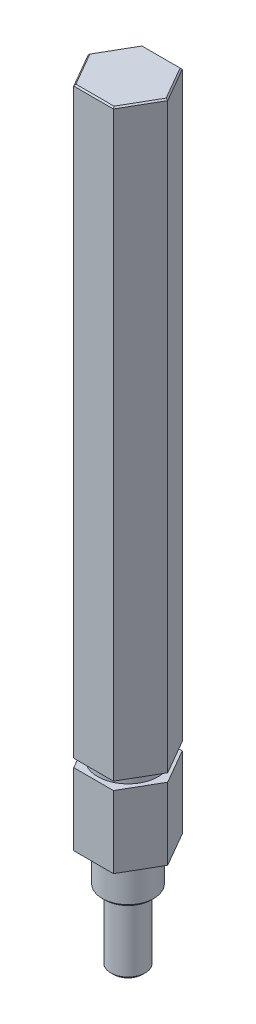
ISO-10303-21;
HEADER;
FILE_DESCRIPTION(('STEP AP214'),'2;1');
FILE_NAME('part.step','',(''),(''),'','','');
FILE_SCHEMA(('AUTOMOTIVE_DESIGN { 1 0 10303 214 1 1 1 1 }'));
ENDSEC;
DATA;
#1=APPLICATION_CONTEXT('core data for automotive mechanical design processes');
#2=APPLICATION_PROTOCOL_DEFINITION('international standard','automotive_design',2000,#1);
#3=PRODUCT_CONTEXT('',#1,'mechanical');
#4=PRODUCT('Part','Part','',(#3));
#5=PRODUCT_RELATED_PRODUCT_CATEGORY('part','',(#4));
#6=PRODUCT_DEFINITION_FORMATION('','',#4);
#7=PRODUCT_DEFINITION_CONTEXT('part definition',#1,'design');
#8=PRODUCT_DEFINITION('design','',#6,#7);
#9=PRODUCT_DEFINITION_SHAPE('','',#8);
#10=(LENGTH_UNIT() NAMED_UNIT(*) SI_UNIT(.MILLI.,.METRE.));
#11=(NAMED_UNIT(*) PLANE_ANGLE_UNIT() SI_UNIT($,.RADIAN.));
#12=(NAMED_UNIT(*) SI_UNIT($,.STERADIAN.) SOLID_ANGLE_UNIT());
#13=UNCERTAINTY_MEASURE_WITH_UNIT(LENGTH_MEASURE(1.E-05),#10,'distance_accuracy_value','');
#14=(GEOMETRIC_REPRESENTATION_CONTEXT(3) GLOBAL_UNCERTAINTY_ASSIGNED_CONTEXT((#13)) GLOBAL_UNIT_ASSIGNED_CONTEXT((#10,
#11,#12)) REPRESENTATION_CONTEXT('',''));
#15=CARTESIAN_POINT('',(0.,0.,0.));
#16=DIRECTION('',(0.,0.,1.));
#17=DIRECTION('',(1.,0.,0.));
#18=AXIS2_PLACEMENT_3D('',#15,#16,#17);
#19=CARTESIAN_POINT('',(-38.3071337161431,-45.212,-16.669011646302));
#20=DIRECTION('',(0.,1.,0.));
#21=DIRECTION('',(0.,0.,1.));
#22=AXIS2_PLACEMENT_3D('',#19,#20,#21);
#23=PLANE('',#22);
#24=CARTESIAN_POINT('',(-38.3071337161431,-45.2119999999923,-16.669011646302));
#25=DIRECTION('',(0.,1.,0.));
#26=DIRECTION('',(0.,0.,1.));
#27=AXIS2_PLACEMENT_3D('',#24,#25,#26);
#28=CIRCLE('',#27,2.65430000009029);
#29=CARTESIAN_POINT('',(-38.3071337161431,-45.2119999999923,-14.0147116462117));
#30=VERTEX_POINT('',#29);
#31=EDGE_CURVE('E17',#30,#30,#28,.T.);
#32=ORIENTED_EDGE('',*,*,#31,.F.);
#33=EDGE_LOOP('',(#32));
#34=FACE_BOUND('',#33,.T.);
#35=ADVANCED_FACE('F14',(#34),#23,.F.);
#36=CARTESIAN_POINT('',(-38.3071337161431,-44.704000000138,-16.669011646302));
#37=DIRECTION('',(0.,1.,0.));
#38=DIRECTION('',(0.,0.,1.));
#39=AXIS2_PLACEMENT_3D('',#36,#37,#38);
#40=CONICAL_SURFACE('',#39,3.16229999994458,0.785398163397448);
#41=CARTESIAN_POINT('',(-38.3071337161431,-44.704,-16.669011646302));
#42=DIRECTION('',(0.,1.,0.));
#43=DIRECTION('',(0.,0.,1.));
#44=AXIS2_PLACEMENT_3D('',#41,#42,#43);
#45=CIRCLE('',#44,3.1623);
#46=CARTESIAN_POINT('',(-38.3071337161431,-44.704,-13.506711646302));
#47=VERTEX_POINT('',#46);
#48=EDGE_CURVE('E151',#47,#47,#45,.T.);
#49=ORIENTED_EDGE('',*,*,#48,.F.);
#50=EDGE_LOOP('',(#49));
#51=FACE_BOUND('',#50,.T.);
#52=ORIENTED_EDGE('',*,*,#31,.T.);
#53=EDGE_LOOP('',(#52));
#54=FACE_BOUND('',#53,.T.);
#55=ADVANCED_FACE('F187',(#51,#54),#40,.T.);
#56=CARTESIAN_POINT('',(-38.3071337161431,-45.212,-16.669011646302));
#57=DIRECTION('',(0.,1.,0.));
#58=DIRECTION('',(0.,0.,1.));
#59=AXIS2_PLACEMENT_3D('',#56,#57,#58);
#60=CYLINDRICAL_SURFACE('',#59,3.1623);
#61=CARTESIAN_POINT('',(-38.3071337161431,-32.512,-16.669011646302));
#62=DIRECTION('',(0.,1.,0.));
#63=DIRECTION('',(0.,0.,1.));
#64=AXIS2_PLACEMENT_3D('',#61,#62,#63);
#65=CIRCLE('',#64,3.1623);
#66=CARTESIAN_POINT('',(-38.3071337161431,-32.512,-13.506711646302));
#67=VERTEX_POINT('',#66);
#68=EDGE_CURVE('E154',#67,#67,#65,.F.);
#69=ORIENTED_EDGE('',*,*,#68,.T.);
#70=EDGE_LOOP('',(#69));
#71=FACE_BOUND('',#70,.T.);
#72=ORIENTED_EDGE('',*,*,#48,.T.);
#73=EDGE_LOOP('',(#72));
#74=FACE_BOUND('',#73,.T.);
#75=ADVANCED_FACE('F171',(#71,#74),#60,.T.);
#76=CARTESIAN_POINT('',(-38.3071337161431,-32.512,-16.669011646302));
#77=DIRECTION('',(0.,1.,0.));
#78=DIRECTION('',(0.,0.,1.));
#79=AXIS2_PLACEMENT_3D('',#76,#77,#78);
#80=PLANE('',#79);
#81=CARTESIAN_POINT('',(-38.3071337161431,-32.511999999997,-16.669011646302));
#82=DIRECTION('',(0.,1.,0.));
#83=DIRECTION('',(0.,0.,1.));
#84=AXIS2_PLACEMENT_3D('',#81,#82,#83);
#85=CIRCLE('',#84,4.24179999994759);
#86=CARTESIAN_POINT('',(-38.3071337161431,-32.511999999997,-12.4272116463544));
#87=VERTEX_POINT('',#86);
#88=EDGE_CURVE('E150',#87,#87,#85,.T.);
#89=ORIENTED_EDGE('',*,*,#88,.F.);
#90=EDGE_LOOP('',(#89));
#91=FACE_BOUND('',#90,.T.);
#92=ORIENTED_EDGE('',*,*,#68,.F.);
#93=EDGE_LOOP('',(#92));
#94=FACE_BOUND('',#93,.T.);
#95=ADVANCED_FACE('F174',(#91,#94),#80,.F.);
#96=CARTESIAN_POINT('',(-38.3071337161431,-32.0039999999722,-16.669011646302));
#97=DIRECTION('',(0.,1.,0.));
#98=DIRECTION('',(0.,0.,1.));
#99=AXIS2_PLACEMENT_3D('',#96,#97,#98);
#100=CONICAL_SURFACE('',#99,4.74979999991557,0.7853981633415);
#101=CARTESIAN_POINT('',(-38.3071337161431,-32.004,-16.669011646302));
#102=DIRECTION('',(0.,1.,0.));
#103=DIRECTION('',(0.,0.,1.));
#104=AXIS2_PLACEMENT_3D('',#101,#102,#103);
#105=CIRCLE('',#104,4.7498);
#106=CARTESIAN_POINT('',(-38.3071337161431,-32.004,-11.919211646302));
#107=VERTEX_POINT('',#106);
#108=EDGE_CURVE('E147',#107,#107,#105,.T.);
#109=ORIENTED_EDGE('',*,*,#108,.F.);
#110=EDGE_LOOP('',(#109));
#111=FACE_BOUND('',#110,.T.);
#112=ORIENTED_EDGE('',*,*,#88,.T.);
#113=EDGE_LOOP('',(#112));
#114=FACE_BOUND('',#113,.T.);
#115=ADVANCED_FACE('F176',(#111,#114),#100,.T.);
#116=CARTESIAN_POINT('',(-38.3071337161431,-32.512,-16.669011646302));
#117=DIRECTION('',(0.,1.,0.));
#118=DIRECTION('',(0.,0.,1.));
#119=AXIS2_PLACEMENT_3D('',#116,#117,#118);
#120=CYLINDRICAL_SURFACE('',#119,4.7498);
#121=CARTESIAN_POINT('',(-38.3071337161431,-25.4,-16.669011646302));
#122=DIRECTION('',(0.,1.,0.));
#123=DIRECTION('',(0.,0.,1.));
#124=AXIS2_PLACEMENT_3D('',#121,#122,#123);
#125=CIRCLE('',#124,4.7498);
#126=CARTESIAN_POINT('',(-38.3071337161431,-25.4,-11.919211646302));
#127=VERTEX_POINT('',#126);
#128=EDGE_CURVE('E129',#127,#127,#125,.F.);
#129=ORIENTED_EDGE('',*,*,#128,.T.);
#130=EDGE_LOOP('',(#129));
#131=FACE_BOUND('',#130,.T.);
#132=ORIENTED_EDGE('',*,*,#108,.T.);
#133=EDGE_LOOP('',(#132));
#134=FACE_BOUND('',#133,.T.);
#135=ADVANCED_FACE('F184',(#131,#134),#120,.T.);
#136=CARTESIAN_POINT('',(-38.3071337161431,-25.4,-3.96901164630201));
#137=DIRECTION('',(0.,1.,0.));
#138=DIRECTION('',(0.,0.,1.));
#139=AXIS2_PLACEMENT_3D('',#136,#137,#138);
#140=PLANE('',#139);
#141=DIRECTION('',(-0.5,0.,0.866025403784439));
#142=VECTOR('',#141,1.);
#143=CARTESIAN_POINT('',(-41.9733079254973,-25.4,-23.019011646302));
#144=LINE('',#143,#142);
#145=CARTESIAN_POINT('',(-41.9733079254973,-25.4,-23.019011646302));
#146=VERTEX_POINT('',#145);
#147=CARTESIAN_POINT('',(-45.6394821348514,-25.4,-16.669011646302));
#148=VERTEX_POINT('',#147);
#149=EDGE_CURVE('E121',#146,#148,#144,.T.);
#150=ORIENTED_EDGE('',*,*,#149,.F.);
#151=DIRECTION('',(-1.,0.,0.));
#152=VECTOR('',#151,1.);
#153=CARTESIAN_POINT('',(-34.640959506789,-25.4,-23.019011646302));
#154=LINE('',#153,#152);
#155=CARTESIAN_POINT('',(-34.640959506789,-25.4,-23.019011646302));
#156=VERTEX_POINT('',#155);
#157=EDGE_CURVE('E118',#156,#146,#154,.T.);
#158=ORIENTED_EDGE('',*,*,#157,.F.);
#159=DIRECTION('',(-0.5,0.,-0.866025403784439));
#160=VECTOR('',#159,1.);
#161=CARTESIAN_POINT('',(-30.9747852974349,-25.4,-16.669011646302));
#162=LINE('',#161,#160);
#163=CARTESIAN_POINT('',(-30.9747852974349,-25.4,-16.669011646302));
#164=VERTEX_POINT('',#163);
#165=EDGE_CURVE('E138',#164,#156,#162,.T.);
#166=ORIENTED_EDGE('',*,*,#165,.F.);
#167=DIRECTION('',(0.500000000000001,0.,-0.866025403784438));
#168=VECTOR('',#167,1.);
#169=CARTESIAN_POINT('',(-34.640959506789,-25.4,-10.319011646302));
#170=LINE('',#169,#168);
#171=CARTESIAN_POINT('',(-34.640959506789,-25.4,-10.319011646302));
#172=VERTEX_POINT('',#171);
#173=EDGE_CURVE('E480',#172,#164,#170,.T.);
#174=ORIENTED_EDGE('',*,*,#173,.F.);
#175=DIRECTION('',(1.,0.,0.));
#176=VECTOR('',#175,1.);
#177=CARTESIAN_POINT('',(-41.9733079254973,-25.4,-10.319011646302));
#178=LINE('',#177,#176);
#179=CARTESIAN_POINT('',(-41.9733079254973,-25.4,-10.319011646302));
#180=VERTEX_POINT('',#179);
#181=EDGE_CURVE('E485',#180,#172,#178,.T.);
#182=ORIENTED_EDGE('',*,*,#181,.F.);
#183=DIRECTION('',(0.5,0.,0.866025403784439));
#184=VECTOR('',#183,1.);
#185=CARTESIAN_POINT('',(-45.6394821348514,-25.4,-16.669011646302));
#186=LINE('',#185,#184);
#187=EDGE_CURVE('E126',#148,#180,#186,.T.);
#188=ORIENTED_EDGE('',*,*,#187,.F.);
#189=EDGE_LOOP('',(#150,#158,#166,#174,#182,#188));
#190=FACE_BOUND('',#189,.T.);
#191=ORIENTED_EDGE('',*,*,#128,.F.);
#192=EDGE_LOOP('',(#191));
#193=FACE_BOUND('',#192,.T.);
#194=ADVANCED_FACE('F123',(#190,#193),#140,.F.);
#195=CARTESIAN_POINT('',(-41.9733079254973,-25.4,-23.019011646302));
#196=DIRECTION('',(-0.866025403784439,0.,-0.5));
#197=DIRECTION('',(-0.5,0.,0.866025403784439));
#198=AXIS2_PLACEMENT_3D('',#195,#196,#197);
#199=PLANE('',#198);
#200=ORIENTED_EDGE('',*,*,#149,.T.);
#201=DIRECTION('',(0.,1.,0.));
#202=VECTOR('',#201,1.);
#203=CARTESIAN_POINT('',(-45.6394821348514,-25.4,-16.669011646302));
#204=LINE('',#203,#202);
#205=CARTESIAN_POINT('',(-45.6394821348514,-12.1158,-16.669011646302));
#206=VERTEX_POINT('',#205);
#207=EDGE_CURVE('E491',#206,#148,#204,.F.);
#208=ORIENTED_EDGE('',*,*,#207,.F.);
#209=DIRECTION('',(0.5,0.,-0.866025403784439));
#210=VECTOR('',#209,1.);
#211=CARTESIAN_POINT('',(-45.6394821348514,-12.1158,-16.669011646302));
#212=LINE('',#211,#210);
#213=CARTESIAN_POINT('',(-41.9733079254973,-12.1158,-23.019011646302));
#214=VERTEX_POINT('',#213);
#215=EDGE_CURVE('E135',#206,#214,#212,.T.);
#216=ORIENTED_EDGE('',*,*,#215,.T.);
#217=DIRECTION('',(0.,1.,0.));
#218=VECTOR('',#217,1.);
#219=CARTESIAN_POINT('',(-41.9733079254973,-25.4,-23.019011646302));
#220=LINE('',#219,#218);
#221=EDGE_CURVE('E132',#146,#214,#220,.T.);
#222=ORIENTED_EDGE('',*,*,#221,.F.);
#223=EDGE_LOOP('',(#200,#208,#216,#222));
#224=FACE_BOUND('',#223,.T.);
#225=ADVANCED_FACE('F133',(#224),#199,.T.);
#226=CARTESIAN_POINT('',(-34.640959506789,-25.4,-23.019011646302));
#227=DIRECTION('',(0.,0.,-1.));
#228=DIRECTION('',(-1.,0.,0.));
#229=AXIS2_PLACEMENT_3D('',#226,#227,#228);
#230=PLANE('',#229);
#231=ORIENTED_EDGE('',*,*,#157,.T.);
#232=ORIENTED_EDGE('',*,*,#221,.T.);
#233=DIRECTION('',(1.,0.,0.));
#234=VECTOR('',#233,1.);
#235=CARTESIAN_POINT('',(-21.7881364409388,-12.1158,-23.019011646302));
#236=LINE('',#235,#234);
#237=CARTESIAN_POINT('',(-34.640959506789,-12.1158,-23.019011646302));
#238=VERTEX_POINT('',#237);
#239=EDGE_CURVE('E502',#214,#238,#236,.T.);
#240=ORIENTED_EDGE('',*,*,#239,.T.);
#241=DIRECTION('',(0.,1.,0.));
#242=VECTOR('',#241,1.);
#243=CARTESIAN_POINT('',(-34.640959506789,-25.4,-23.019011646302));
#244=LINE('',#243,#242);
#245=EDGE_CURVE('E142',#156,#238,#244,.T.);
#246=ORIENTED_EDGE('',*,*,#245,.F.);
#247=EDGE_LOOP('',(#231,#232,#240,#246));
#248=FACE_BOUND('',#247,.T.);
#249=ADVANCED_FACE('F140',(#248),#230,.T.);
#250=CARTESIAN_POINT('',(-30.9747852974349,-25.4,-16.669011646302));
#251=DIRECTION('',(0.866025403784439,0.,-0.5));
#252=DIRECTION('',(-0.5,0.,-0.866025403784439));
#253=AXIS2_PLACEMENT_3D('',#250,#251,#252);
#254=PLANE('',#253);
#255=ORIENTED_EDGE('',*,*,#165,.T.);
#256=ORIENTED_EDGE('',*,*,#245,.T.);
#257=DIRECTION('',(0.5,0.,0.866025403784438));
#258=VECTOR('',#257,1.);
#259=CARTESIAN_POINT('',(-34.640959506789,-12.1158,-23.019011646302));
#260=LINE('',#259,#258);
#261=CARTESIAN_POINT('',(-30.9747852974349,-12.1158,-16.669011646302));
#262=VERTEX_POINT('',#261);
#263=EDGE_CURVE('E504',#238,#262,#260,.T.);
#264=ORIENTED_EDGE('',*,*,#263,.T.);
#265=DIRECTION('',(0.,1.,0.));
#266=VECTOR('',#265,1.);
#267=CARTESIAN_POINT('',(-30.9747852974349,-25.4,-16.669011646302));
#268=LINE('',#267,#266);
#269=EDGE_CURVE('E478',#164,#262,#268,.T.);
#270=ORIENTED_EDGE('',*,*,#269,.F.);
#271=EDGE_LOOP('',(#255,#256,#264,#270));
#272=FACE_BOUND('',#271,.T.);
#273=ADVANCED_FACE('F268',(#272),#254,.T.);
#274=CARTESIAN_POINT('',(-34.640959506789,-25.4,-10.319011646302));
#275=DIRECTION('',(0.866025403784438,0.,0.500000000000001));
#276=DIRECTION('',(0.500000000000001,0.,-0.866025403784438));
#277=AXIS2_PLACEMENT_3D('',#274,#275,#276);
#278=PLANE('',#277);
#279=ORIENTED_EDGE('',*,*,#173,.T.);
#280=ORIENTED_EDGE('',*,*,#269,.T.);
#281=DIRECTION('',(-0.500000000000001,0.,0.866025403784438));
#282=VECTOR('',#281,1.);
#283=CARTESIAN_POINT('',(-30.9747852974349,-12.1158,-16.669011646302));
#284=LINE('',#283,#282);
#285=CARTESIAN_POINT('',(-34.640959506789,-12.1158,-10.319011646302));
#286=VERTEX_POINT('',#285);
#287=EDGE_CURVE('E506',#262,#286,#284,.T.);
#288=ORIENTED_EDGE('',*,*,#287,.T.);
#289=DIRECTION('',(0.,1.,0.));
#290=VECTOR('',#289,1.);
#291=CARTESIAN_POINT('',(-34.640959506789,-25.4,-10.319011646302));
#292=LINE('',#291,#290);
#293=EDGE_CURVE('E488',#172,#286,#292,.T.);
#294=ORIENTED_EDGE('',*,*,#293,.F.);
#295=EDGE_LOOP('',(#279,#280,#288,#294));
#296=FACE_BOUND('',#295,.T.);
#297=ADVANCED_FACE('F264',(#296),#278,.T.);
#298=CARTESIAN_POINT('',(-41.9733079254973,-25.4,-10.319011646302));
#299=DIRECTION('',(0.,0.,1.));
#300=DIRECTION('',(1.,0.,0.));
#301=AXIS2_PLACEMENT_3D('',#298,#299,#300);
#302=PLANE('',#301);
#303=ORIENTED_EDGE('',*,*,#181,.T.);
#304=ORIENTED_EDGE('',*,*,#293,.T.);
#305=DIRECTION('',(1.,0.,0.));
#306=VECTOR('',#305,1.);
#307=CARTESIAN_POINT('',(-21.7881364409388,-12.1158,-10.319011646302));
#308=LINE('',#307,#306);
#309=CARTESIAN_POINT('',(-41.9733079254973,-12.1158,-10.319011646302));
#310=VERTEX_POINT('',#309);
#311=EDGE_CURVE('E508',#286,#310,#308,.F.);
#312=ORIENTED_EDGE('',*,*,#311,.T.);
#313=DIRECTION('',(0.,1.,0.));
#314=VECTOR('',#313,1.);
#315=CARTESIAN_POINT('',(-41.9733079254973,-25.4,-10.319011646302));
#316=LINE('',#315,#314);
#317=EDGE_CURVE('E494',#180,#310,#316,.T.);
#318=ORIENTED_EDGE('',*,*,#317,.F.);
#319=EDGE_LOOP('',(#303,#304,#312,#318));
#320=FACE_BOUND('',#319,.T.);
#321=ADVANCED_FACE('F260',(#320),#302,.T.);
#322=CARTESIAN_POINT('',(-45.6394821348514,-25.4,-16.669011646302));
#323=DIRECTION('',(-0.866025403784439,0.,0.5));
#324=DIRECTION('',(0.5,0.,0.866025403784439));
#325=AXIS2_PLACEMENT_3D('',#322,#323,#324);
#326=PLANE('',#325);
#327=ORIENTED_EDGE('',*,*,#187,.T.);
#328=ORIENTED_EDGE('',*,*,#317,.T.);
#329=DIRECTION('',(-0.5,0.,-0.866025403784438));
#330=VECTOR('',#329,1.);
#331=CARTESIAN_POINT('',(-41.9733079254973,-12.1158,-10.319011646302));
#332=LINE('',#331,#330);
#333=EDGE_CURVE('E510',#310,#206,#332,.T.);
#334=ORIENTED_EDGE('',*,*,#333,.T.);
#335=ORIENTED_EDGE('',*,*,#207,.T.);
#336=EDGE_LOOP('',(#327,#328,#334,#335));
#337=FACE_BOUND('',#336,.T.);
#338=ADVANCED_FACE('F256',(#337),#326,.T.);
#339=CARTESIAN_POINT('',(-38.3071337161451,97.0813400000005,-10.573011646302));
#340=DIRECTION('',(0.,-0.707106781186544,-0.707106781186551));
#341=DIRECTION('',(0.,0.707106781186551,-0.707106781186544));
#342=AXIS2_PLACEMENT_3D('',#339,#340,#341);
#343=PLANE('',#342);
#344=DIRECTION('',(1.,0.,0.));
#345=VECTOR('',#344,1.);
#346=CARTESIAN_POINT('',(-41.9733079254973,96.8273400000005,-10.319011646302));
#347=LINE('',#346,#345);
#348=CARTESIAN_POINT('',(-34.640959506789,96.8273400000005,-10.319011646302));
#349=VERTEX_POINT('',#348);
#350=CARTESIAN_POINT('',(-41.9733079254973,96.8273400000005,-10.319011646302));
#351=VERTEX_POINT('',#350);
#352=EDGE_CURVE('E533',#349,#351,#347,.F.);
#353=ORIENTED_EDGE('',*,*,#352,.F.);
#354=DIRECTION('',(-0.377964473009223,0.654653670707976,-0.654653670707981));
#355=VECTOR('',#354,1.);
#356=CARTESIAN_POINT('',(-34.640959506789,96.8273400000005,-10.319011646302));
#357=LINE('',#356,#355);
#358=CARTESIAN_POINT('',(-34.7876064751632,97.0813400000005,-10.573011646302));
#359=VERTEX_POINT('',#358);
#360=EDGE_CURVE('E497',#349,#359,#357,.T.);
#361=ORIENTED_EDGE('',*,*,#360,.T.);
#362=DIRECTION('',(1.,0.,0.));
#363=VECTOR('',#362,1.);
#364=CARTESIAN_POINT('',(-38.3071337161451,97.0813400000005,-10.573011646302));
#365=LINE('',#364,#363);
#366=CARTESIAN_POINT('',(-41.8266609571231,97.0813400000005,-10.573011646302));
#367=VERTEX_POINT('',#366);
#368=EDGE_CURVE('E520',#367,#359,#365,.T.);
#369=ORIENTED_EDGE('',*,*,#368,.F.);
#370=DIRECTION('',(-0.377964473009255,-0.654653670707976,0.654653670707962));
#371=VECTOR('',#370,1.);
#372=CARTESIAN_POINT('',(-41.8266609571231,97.0813400000005,-10.573011646302));
#373=LINE('',#372,#371);
#374=EDGE_CURVE('E513',#367,#351,#373,.T.);
#375=ORIENTED_EDGE('',*,*,#374,.T.);
#376=EDGE_LOOP('',(#353,#361,#369,#375));
#377=FACE_BOUND('',#376,.T.);
#378=ADVANCED_FACE('F252',(#377),#343,.F.);
#379=CARTESIAN_POINT('',(-33.0278428546734,97.0813400000005,-13.6210116463016));
#380=DIRECTION('',(-0.612372435695796,-0.707106781186546,-0.353553390593275));
#381=DIRECTION('',(0.755928946018453,-0.654653670707979,0.));
#382=AXIS2_PLACEMENT_3D('',#379,#380,#381);
#383=PLANE('',#382);
#384=DIRECTION('',(0.500000000000001,0.,-0.866025403784438));
#385=VECTOR('',#384,1.);
#386=CARTESIAN_POINT('',(-34.7876064751632,97.0813400000005,-10.573011646302));
#387=LINE('',#386,#385);
#388=CARTESIAN_POINT('',(-31.2680792341832,97.0813400000005,-16.669011646302));
#389=VERTEX_POINT('',#388);
#390=EDGE_CURVE('E523',#359,#389,#387,.T.);
#391=ORIENTED_EDGE('',*,*,#390,.F.);
#392=ORIENTED_EDGE('',*,*,#360,.F.);
#393=DIRECTION('',(0.500000000000001,0.,-0.866025403784438));
#394=VECTOR('',#393,1.);
#395=CARTESIAN_POINT('',(-34.640959506789,96.8273400000004,-10.319011646302));
#396=LINE('',#395,#394);
#397=CARTESIAN_POINT('',(-30.9747852974349,96.8273400000005,-16.669011646302));
#398=VERTEX_POINT('',#397);
#399=EDGE_CURVE('E536',#398,#349,#396,.F.);
#400=ORIENTED_EDGE('',*,*,#399,.F.);
#401=DIRECTION('',(0.755928946018445,-0.654653670707988,0.));
#402=VECTOR('',#401,1.);
#403=CARTESIAN_POINT('',(-32.2736584458922,97.952197142858,-16.669011646302));
#404=LINE('',#403,#402);
#405=EDGE_CURVE('E499',#398,#389,#404,.F.);
#406=ORIENTED_EDGE('',*,*,#405,.T.);
#407=EDGE_LOOP('',(#391,#392,#400,#406));
#408=FACE_BOUND('',#407,.T.);
#409=ADVANCED_FACE('F248',(#408),#383,.F.);
#410=CARTESIAN_POINT('',(-33.0278428546739,97.0813400000005,-19.7170116463033));
#411=DIRECTION('',(-0.612372435695803,-0.707106781186538,0.353553390593279));
#412=DIRECTION('',(0.755928946018445,-0.654653670707988,0.));
#413=AXIS2_PLACEMENT_3D('',#410,#411,#412);
#414=PLANE('',#413);
#415=DIRECTION('',(-0.5,0.,-0.866025403784439));
#416=VECTOR('',#415,1.);
#417=CARTESIAN_POINT('',(-31.2680792341832,97.0813400000005,-16.669011646302));
#418=LINE('',#417,#416);
#419=CARTESIAN_POINT('',(-34.7876064751632,97.0813400000005,-22.765011646302));
#420=VERTEX_POINT('',#419);
#421=EDGE_CURVE('E526',#389,#420,#418,.T.);
#422=ORIENTED_EDGE('',*,*,#421,.F.);
#423=ORIENTED_EDGE('',*,*,#405,.F.);
#424=DIRECTION('',(-0.5,0.,-0.866025403784439));
#425=VECTOR('',#424,1.);
#426=CARTESIAN_POINT('',(-30.9747852974349,96.8273400000005,-16.669011646302));
#427=LINE('',#426,#425);
#428=CARTESIAN_POINT('',(-34.640959506789,96.8273400000005,-23.019011646302));
#429=VERTEX_POINT('',#428);
#430=EDGE_CURVE('E542',#429,#398,#427,.F.);
#431=ORIENTED_EDGE('',*,*,#430,.F.);
#432=DIRECTION('',(-0.377964473009211,0.654653670707982,0.654653670707982));
#433=VECTOR('',#432,1.);
#434=CARTESIAN_POINT('',(-34.640959506789,96.8273400000005,-23.019011646302));
#435=LINE('',#434,#433);
#436=EDGE_CURVE('E530',#429,#420,#435,.T.);
#437=ORIENTED_EDGE('',*,*,#436,.T.);
#438=EDGE_LOOP('',(#422,#423,#431,#437));
#439=FACE_BOUND('',#438,.T.);
#440=ADVANCED_FACE('F244',(#439),#414,.F.);
#441=CARTESIAN_POINT('',(-21.7881364409388,-12.1158,-16.669011646302));
#442=DIRECTION('',(0.,-1.,0.));
#443=DIRECTION('',(0.,0.,-1.));
#444=AXIS2_PLACEMENT_3D('',#441,#442,#443);
#445=PLANE('',#444);
#446=ORIENTED_EDGE('',*,*,#311,.F.);
#447=ORIENTED_EDGE('',*,*,#287,.F.);
#448=ORIENTED_EDGE('',*,*,#263,.F.);
#449=ORIENTED_EDGE('',*,*,#239,.F.);
#450=ORIENTED_EDGE('',*,*,#215,.F.);
#451=ORIENTED_EDGE('',*,*,#333,.F.);
#452=EDGE_LOOP('',(#446,#447,#448,#449,#450,#451));
#453=FACE_BOUND('',#452,.T.);
#454=CARTESIAN_POINT('',(-38.3071337161431,-12.1158,-16.669011646302));
#455=DIRECTION('',(0.,1.,0.));
#456=DIRECTION('',(0.,0.,1.));
#457=AXIS2_PLACEMENT_3D('',#454,#455,#456);
#458=CIRCLE('',#457,5.58800000000003);
#459=CARTESIAN_POINT('',(-38.3071337161431,-12.1158,-11.081011646302));
#460=VERTEX_POINT('',#459);
#461=EDGE_CURVE('E160',#460,#460,#458,.T.);
#462=ORIENTED_EDGE('',*,*,#461,.F.);
#463=EDGE_LOOP('',(#462));
#464=FACE_BOUND('',#463,.T.);
#465=ADVANCED_FACE('F240',(#453,#464),#445,.F.);
#466=CARTESIAN_POINT('',(-43.5864245776138,97.0813400000005,-13.6210116463033));
#467=DIRECTION('',(0.612372435695786,-0.707106781186557,-0.353553390593269));
#468=DIRECTION('',(0.755928946018463,0.654653670707967,0.));
#469=AXIS2_PLACEMENT_3D('',#466,#467,#468);
#470=PLANE('',#469);
#471=DIRECTION('',(0.5,0.,0.866025403784439));
#472=VECTOR('',#471,1.);
#473=CARTESIAN_POINT('',(-45.6394821348514,96.8273400000005,-16.669011646302));
#474=LINE('',#473,#472);
#475=CARTESIAN_POINT('',(-45.6394821348514,96.8273400000005,-16.669011646302));
#476=VERTEX_POINT('',#475);
#477=EDGE_CURVE('E549',#351,#476,#474,.F.);
#478=ORIENTED_EDGE('',*,*,#477,.F.);
#479=ORIENTED_EDGE('',*,*,#374,.F.);
#480=DIRECTION('',(0.5,0.,0.866025403784439));
#481=VECTOR('',#480,1.);
#482=CARTESIAN_POINT('',(-45.3461881981031,97.0813400000005,-16.669011646302));
#483=LINE('',#482,#481);
#484=CARTESIAN_POINT('',(-45.346188198103,97.0813400000005,-16.669011646302));
#485=VERTEX_POINT('',#484);
#486=EDGE_CURVE('E517',#485,#367,#483,.T.);
#487=ORIENTED_EDGE('',*,*,#486,.F.);
#488=DIRECTION('',(0.755928946018463,0.654653670707967,0.));
#489=VECTOR('',#488,1.);
#490=CARTESIAN_POINT('',(-44.3406089863949,97.9521971428572,-16.669011646302));
#491=LINE('',#490,#489);
#492=EDGE_CURVE('E515',#476,#485,#491,.T.);
#493=ORIENTED_EDGE('',*,*,#492,.F.);
#494=EDGE_LOOP('',(#478,#479,#487,#493));
#495=FACE_BOUND('',#494,.T.);
#496=ADVANCED_FACE('F236',(#495),#470,.F.);
#497=CARTESIAN_POINT('',(-38.3071337161451,97.0813400000005,-16.6690116463026));
#498=DIRECTION('',(0.,1.,0.));
#499=DIRECTION('',(0.,0.,1.));
#500=AXIS2_PLACEMENT_3D('',#497,#498,#499);
#501=PLANE('',#500);
#502=DIRECTION('',(1.,0.,0.));
#503=VECTOR('',#502,1.);
#504=CARTESIAN_POINT('',(-38.3071337161451,97.0813400000005,-22.765011646302));
#505=LINE('',#504,#503);
#506=CARTESIAN_POINT('',(-41.8266609571231,97.0813400000005,-22.765011646302));
#507=VERTEX_POINT('',#506);
#508=EDGE_CURVE('E528',#420,#507,#505,.F.);
#509=ORIENTED_EDGE('',*,*,#508,.T.);
#510=DIRECTION('',(-0.500000000000001,0.,0.866025403784438));
#511=VECTOR('',#510,1.);
#512=CARTESIAN_POINT('',(-41.8266609571231,97.0813400000005,-22.765011646302));
#513=LINE('',#512,#511);
#514=EDGE_CURVE('E552',#507,#485,#513,.T.);
#515=ORIENTED_EDGE('',*,*,#514,.T.);
#516=ORIENTED_EDGE('',*,*,#486,.T.);
#517=ORIENTED_EDGE('',*,*,#368,.T.);
#518=ORIENTED_EDGE('',*,*,#390,.T.);
#519=ORIENTED_EDGE('',*,*,#421,.T.);
#520=EDGE_LOOP('',(#509,#515,#516,#517,#518,#519));
#521=FACE_BOUND('',#520,.T.);
#522=ADVANCED_FACE('F232',(#521),#501,.T.);
#523=CARTESIAN_POINT('',(-38.3071337161451,97.0813400000005,-22.765011646302));
#524=DIRECTION('',(0.,-0.707106781186551,0.707106781186544));
#525=DIRECTION('',(0.,-0.707106781186544,-0.707106781186551));
#526=AXIS2_PLACEMENT_3D('',#523,#524,#525);
#527=PLANE('',#526);
#528=DIRECTION('',(-1.,0.,0.));
#529=VECTOR('',#528,1.);
#530=CARTESIAN_POINT('',(-34.640959506789,96.8273400000005,-23.019011646302));
#531=LINE('',#530,#529);
#532=CARTESIAN_POINT('',(-41.9733079254973,96.8273400000005,-23.019011646302));
#533=VERTEX_POINT('',#532);
#534=EDGE_CURVE('E558',#533,#429,#531,.F.);
#535=ORIENTED_EDGE('',*,*,#534,.F.);
#536=DIRECTION('',(0.377964473009259,0.654653670707977,0.654653670707959));
#537=VECTOR('',#536,1.);
#538=CARTESIAN_POINT('',(-41.9733079254973,96.8273400000005,-23.019011646302));
#539=LINE('',#538,#537);
#540=EDGE_CURVE('E555',#533,#507,#539,.T.);
#541=ORIENTED_EDGE('',*,*,#540,.T.);
#542=ORIENTED_EDGE('',*,*,#508,.F.);
#543=ORIENTED_EDGE('',*,*,#436,.F.);
#544=EDGE_LOOP('',(#535,#541,#542,#543));
#545=FACE_BOUND('',#544,.T.);
#546=ADVANCED_FACE('F228',(#545),#527,.F.);
#547=CARTESIAN_POINT('',(-41.9733079254973,-25.4,-10.319011646302));
#548=DIRECTION('',(0.,0.,1.));
#549=DIRECTION('',(1.,0.,0.));
#550=AXIS2_PLACEMENT_3D('',#547,#548,#549);
#551=PLANE('',#550);
#552=DIRECTION('',(0.,1.,0.));
#553=VECTOR('',#552,1.);
#554=CARTESIAN_POINT('',(-41.9733079254973,-25.4,-10.319011646302));
#555=LINE('',#554,#553);
#556=CARTESIAN_POINT('',(-41.9733079254973,-10.6172,-10.319011646302));
#557=VERTEX_POINT('',#556);
#558=EDGE_CURVE('E163',#557,#351,#555,.T.);
#559=ORIENTED_EDGE('',*,*,#558,.F.);
#560=DIRECTION('',(1.,0.,0.));
#561=VECTOR('',#560,1.);
#562=CARTESIAN_POINT('',(-32.7191337161431,-10.6172,-10.319011646302));
#563=LINE('',#562,#561);
#564=CARTESIAN_POINT('',(-34.640959506789,-10.6172,-10.319011646302));
#565=VERTEX_POINT('',#564);
#566=EDGE_CURVE('E567',#557,#565,#563,.T.);
#567=ORIENTED_EDGE('',*,*,#566,.T.);
#568=DIRECTION('',(0.,1.,0.));
#569=VECTOR('',#568,1.);
#570=CARTESIAN_POINT('',(-34.640959506789,-25.4,-10.319011646302));
#571=LINE('',#570,#569);
#572=EDGE_CURVE('E539',#349,#565,#571,.F.);
#573=ORIENTED_EDGE('',*,*,#572,.F.);
#574=ORIENTED_EDGE('',*,*,#352,.T.);
#575=EDGE_LOOP('',(#559,#567,#573,#574));
#576=FACE_BOUND('',#575,.T.);
#577=ADVANCED_FACE('F224',(#576),#551,.T.);
#578=CARTESIAN_POINT('',(-34.640959506789,-25.4,-10.319011646302));
#579=DIRECTION('',(0.866025403784438,0.,0.500000000000001));
#580=DIRECTION('',(0.500000000000001,0.,-0.866025403784438));
#581=AXIS2_PLACEMENT_3D('',#578,#579,#580);
#582=PLANE('',#581);
#583=ORIENTED_EDGE('',*,*,#572,.T.);
#584=DIRECTION('',(0.500000000000001,0.,-0.866025403784438));
#585=VECTOR('',#584,1.);
#586=CARTESIAN_POINT('',(-34.640959506789,-10.6172,-10.319011646302));
#587=LINE('',#586,#585);
#588=CARTESIAN_POINT('',(-30.9747852974349,-10.6172,-16.669011646302));
#589=VERTEX_POINT('',#588);
#590=EDGE_CURVE('E569',#565,#589,#587,.T.);
#591=ORIENTED_EDGE('',*,*,#590,.T.);
#592=DIRECTION('',(0.,1.,0.));
#593=VECTOR('',#592,1.);
#594=CARTESIAN_POINT('',(-30.9747852974349,-25.4,-16.669011646302));
#595=LINE('',#594,#593);
#596=EDGE_CURVE('E164',#398,#589,#595,.F.);
#597=ORIENTED_EDGE('',*,*,#596,.F.);
#598=ORIENTED_EDGE('',*,*,#399,.T.);
#599=EDGE_LOOP('',(#583,#591,#597,#598));
#600=FACE_BOUND('',#599,.T.);
#601=ADVANCED_FACE('F220',(#600),#582,.T.);
#602=CARTESIAN_POINT('',(-30.9747852974349,-25.4,-16.669011646302));
#603=DIRECTION('',(0.866025403784439,0.,-0.5));
#604=DIRECTION('',(-0.5,0.,-0.866025403784439));
#605=AXIS2_PLACEMENT_3D('',#602,#603,#604);
#606=PLANE('',#605);
#607=ORIENTED_EDGE('',*,*,#596,.T.);
#608=DIRECTION('',(-0.5,0.,-0.866025403784438));
#609=VECTOR('',#608,1.);
#610=CARTESIAN_POINT('',(-30.9747852974349,-10.6172,-16.669011646302));
#611=LINE('',#610,#609);
#612=CARTESIAN_POINT('',(-34.640959506789,-10.6172,-23.019011646302));
#613=VERTEX_POINT('',#612);
#614=EDGE_CURVE('E159',#589,#613,#611,.T.);
#615=ORIENTED_EDGE('',*,*,#614,.T.);
#616=DIRECTION('',(0.,1.,0.));
#617=VECTOR('',#616,1.);
#618=CARTESIAN_POINT('',(-34.640959506789,-25.4,-23.019011646302));
#619=LINE('',#618,#617);
#620=EDGE_CURVE('E561',#429,#613,#619,.F.);
#621=ORIENTED_EDGE('',*,*,#620,.F.);
#622=ORIENTED_EDGE('',*,*,#430,.T.);
#623=EDGE_LOOP('',(#607,#615,#621,#622));
#624=FACE_BOUND('',#623,.T.);
#625=ADVANCED_FACE('F216',(#624),#606,.T.);
#626=CARTESIAN_POINT('',(-38.3071337161431,-25.4,-16.669011646302));
#627=DIRECTION('',(0.,1.,0.));
#628=DIRECTION('',(0.,0.,1.));
#629=AXIS2_PLACEMENT_3D('',#626,#627,#628);
#630=CYLINDRICAL_SURFACE('',#629,5.58800000000003);
#631=CARTESIAN_POINT('',(-38.3071337161431,-10.6172,-16.669011646302));
#632=DIRECTION('',(0.,1.,0.));
#633=DIRECTION('',(0.,0.,1.));
#634=AXIS2_PLACEMENT_3D('',#631,#632,#633);
#635=CIRCLE('',#634,5.58800000000003);
#636=CARTESIAN_POINT('',(-38.3071337161431,-10.6172,-11.081011646302));
#637=VERTEX_POINT('',#636);
#638=EDGE_CURVE('E155',#637,#637,#635,.F.);
#639=ORIENTED_EDGE('',*,*,#638,.T.);
#640=EDGE_LOOP('',(#639));
#641=FACE_BOUND('',#640,.T.);
#642=ORIENTED_EDGE('',*,*,#461,.T.);
#643=EDGE_LOOP('',(#642));
#644=FACE_BOUND('',#643,.T.);
#645=ADVANCED_FACE('F212',(#641,#644),#630,.T.);
#646=CARTESIAN_POINT('',(-45.6394821348514,-25.4,-16.669011646302));
#647=DIRECTION('',(-0.866025403784439,0.,0.5));
#648=DIRECTION('',(0.5,0.,0.866025403784439));
#649=AXIS2_PLACEMENT_3D('',#646,#647,#648);
#650=PLANE('',#649);
#651=DIRECTION('',(0.,1.,0.));
#652=VECTOR('',#651,1.);
#653=CARTESIAN_POINT('',(-45.6394821348514,-25.4,-16.669011646302));
#654=LINE('',#653,#652);
#655=CARTESIAN_POINT('',(-45.6394821348514,-10.6172,-16.669011646302));
#656=VERTEX_POINT('',#655);
#657=EDGE_CURVE('E158',#656,#476,#654,.T.);
#658=ORIENTED_EDGE('',*,*,#657,.F.);
#659=DIRECTION('',(0.5,0.,0.866025403784438));
#660=VECTOR('',#659,1.);
#661=CARTESIAN_POINT('',(-45.6394821348514,-10.6172,-16.669011646302));
#662=LINE('',#661,#660);
#663=EDGE_CURVE('E564',#656,#557,#662,.T.);
#664=ORIENTED_EDGE('',*,*,#663,.T.);
#665=ORIENTED_EDGE('',*,*,#558,.T.);
#666=ORIENTED_EDGE('',*,*,#477,.T.);
#667=EDGE_LOOP('',(#658,#664,#665,#666));
#668=FACE_BOUND('',#667,.T.);
#669=ADVANCED_FACE('F208',(#668),#650,.T.);
#670=CARTESIAN_POINT('',(-43.5864245776133,97.0813400000005,-19.7170116463016));
#671=DIRECTION('',(0.612372435695792,-0.70710678118655,0.353553390593273));
#672=DIRECTION('',(0.755928946018457,0.654653670707975,0.));
#673=AXIS2_PLACEMENT_3D('',#670,#671,#672);
#674=PLANE('',#673);
#675=DIRECTION('',(-0.5,0.,0.866025403784439));
#676=VECTOR('',#675,1.);
#677=CARTESIAN_POINT('',(-41.9733079254973,96.8273400000005,-23.019011646302));
#678=LINE('',#677,#676);
#679=EDGE_CURVE('E575',#476,#533,#678,.F.);
#680=ORIENTED_EDGE('',*,*,#679,.F.);
#681=ORIENTED_EDGE('',*,*,#492,.T.);
#682=ORIENTED_EDGE('',*,*,#514,.F.);
#683=ORIENTED_EDGE('',*,*,#540,.F.);
#684=EDGE_LOOP('',(#680,#681,#682,#683));
#685=FACE_BOUND('',#684,.T.);
#686=ADVANCED_FACE('F205',(#685),#674,.F.);
#687=CARTESIAN_POINT('',(-34.640959506789,-25.4,-23.019011646302));
#688=DIRECTION('',(0.,0.,-1.));
#689=DIRECTION('',(-1.,0.,0.));
#690=AXIS2_PLACEMENT_3D('',#687,#688,#689);
#691=PLANE('',#690);
#692=ORIENTED_EDGE('',*,*,#620,.T.);
#693=DIRECTION('',(1.,0.,0.));
#694=VECTOR('',#693,1.);
#695=CARTESIAN_POINT('',(-32.7191337161431,-10.6172,-23.019011646302));
#696=LINE('',#695,#694);
#697=CARTESIAN_POINT('',(-41.9733079254973,-10.6172,-23.019011646302));
#698=VERTEX_POINT('',#697);
#699=EDGE_CURVE('E32',#613,#698,#696,.F.);
#700=ORIENTED_EDGE('',*,*,#699,.T.);
#701=DIRECTION('',(0.,1.,0.));
#702=VECTOR('',#701,1.);
#703=CARTESIAN_POINT('',(-41.9733079254973,-25.4,-23.019011646302));
#704=LINE('',#703,#702);
#705=EDGE_CURVE('E23',#533,#698,#704,.F.);
#706=ORIENTED_EDGE('',*,*,#705,.F.);
#707=ORIENTED_EDGE('',*,*,#534,.T.);
#708=EDGE_LOOP('',(#692,#700,#706,#707));
#709=FACE_BOUND('',#708,.T.);
#710=ADVANCED_FACE('F198',(#709),#691,.T.);
#711=CARTESIAN_POINT('',(-32.7191337161431,-10.6172,-16.669011646302));
#712=DIRECTION('',(0.,1.,0.));
#713=DIRECTION('',(0.,0.,1.));
#714=AXIS2_PLACEMENT_3D('',#711,#712,#713);
#715=PLANE('',#714);
#716=ORIENTED_EDGE('',*,*,#638,.F.);
#717=EDGE_LOOP('',(#716));
#718=FACE_BOUND('',#717,.T.);
#719=ORIENTED_EDGE('',*,*,#590,.F.);
#720=ORIENTED_EDGE('',*,*,#566,.F.);
#721=ORIENTED_EDGE('',*,*,#663,.F.);
#722=DIRECTION('',(-0.5,0.,0.866025403784439));
#723=VECTOR('',#722,1.);
#724=CARTESIAN_POINT('',(-41.9733079254973,-10.6172,-23.019011646302));
#725=LINE('',#724,#723);
#726=EDGE_CURVE('E9',#698,#656,#725,.T.);
#727=ORIENTED_EDGE('',*,*,#726,.F.);
#728=ORIENTED_EDGE('',*,*,#699,.F.);
#729=ORIENTED_EDGE('',*,*,#614,.F.);
#730=EDGE_LOOP('',(#719,#720,#721,#727,#728,#729));
#731=FACE_BOUND('',#730,.T.);
#732=ADVANCED_FACE('F192',(#718,#731),#715,.F.);
#733=CARTESIAN_POINT('',(-41.9733079254973,-25.4,-23.019011646302));
#734=DIRECTION('',(-0.866025403784439,0.,-0.5));
#735=DIRECTION('',(-0.5,0.,0.866025403784439));
#736=AXIS2_PLACEMENT_3D('',#733,#734,#735);
#737=PLANE('',#736);
#738=ORIENTED_EDGE('',*,*,#705,.T.);
#739=ORIENTED_EDGE('',*,*,#726,.T.);
#740=ORIENTED_EDGE('',*,*,#657,.T.);
#741=ORIENTED_EDGE('',*,*,#679,.T.);
#742=EDGE_LOOP('',(#738,#739,#740,#741));
#743=FACE_BOUND('',#742,.T.);
#744=ADVANCED_FACE('F190',(#743),#737,.T.);
#745=CLOSED_SHELL('',(#35,#55,#75,#95,#115,#135,#194,#225,#249,#273,#297,#321,#338,#378,#409,
#440,#465,#496,#522,#546,#577,#601,#625,#645,#669,#686,#710,#732,#744));
#746=MANIFOLD_SOLID_BREP('B1',#745);
#747=ADVANCED_BREP_SHAPE_REPRESENTATION('',(#18,#746),#14);
#748=SHAPE_DEFINITION_REPRESENTATION(#9,#747);
ENDSEC;
END-ISO-10303-21;
